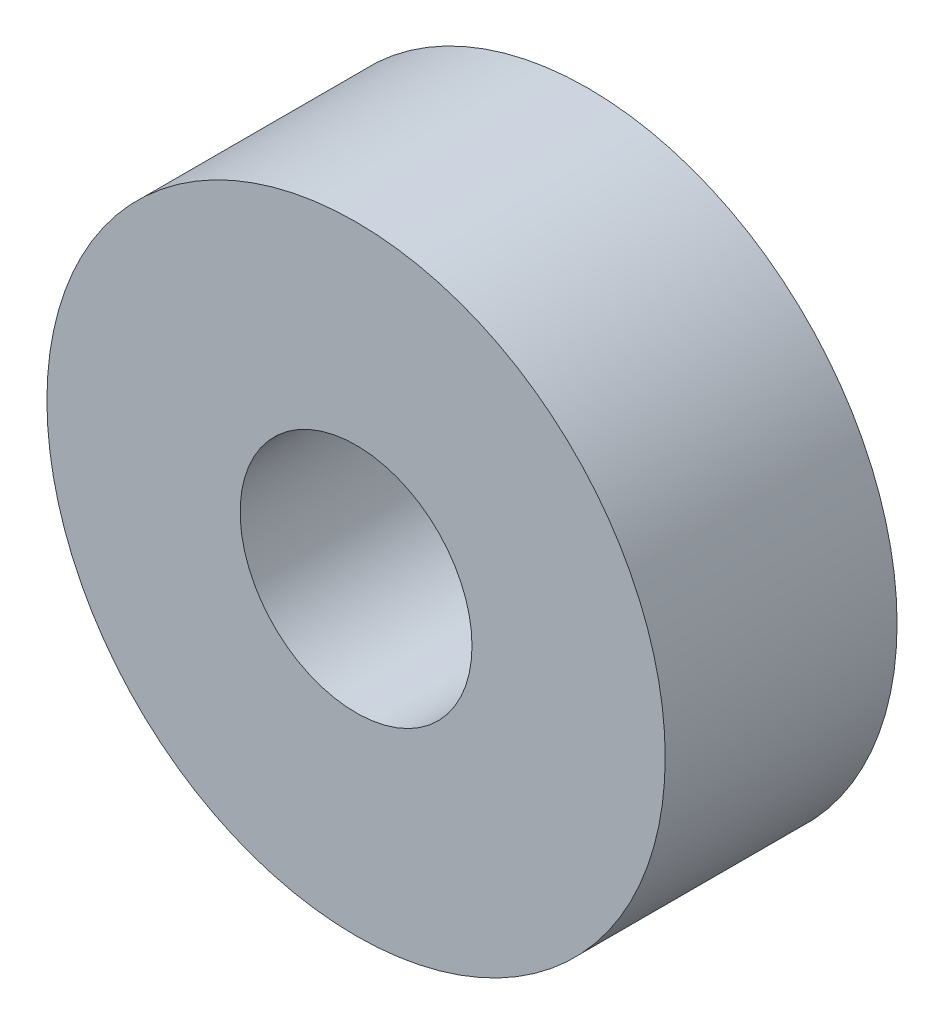
ISO-10303-21;
HEADER;
FILE_DESCRIPTION(('STEP AP214'),'2;1');
FILE_NAME('part.step','',(''),(''),'','','');
FILE_SCHEMA(('AUTOMOTIVE_DESIGN { 1 0 10303 214 1 1 1 1 }'));
ENDSEC;
DATA;
#1=APPLICATION_CONTEXT('core data for automotive mechanical design processes');
#2=APPLICATION_PROTOCOL_DEFINITION('international standard','automotive_design',2000,#1);
#3=PRODUCT_CONTEXT('',#1,'mechanical');
#4=PRODUCT('Part','Part','',(#3));
#5=PRODUCT_RELATED_PRODUCT_CATEGORY('part','',(#4));
#6=PRODUCT_DEFINITION_FORMATION('','',#4);
#7=PRODUCT_DEFINITION_CONTEXT('part definition',#1,'design');
#8=PRODUCT_DEFINITION('design','',#6,#7);
#9=PRODUCT_DEFINITION_SHAPE('','',#8);
#10=(LENGTH_UNIT() NAMED_UNIT(*) SI_UNIT(.MILLI.,.METRE.));
#11=(NAMED_UNIT(*) PLANE_ANGLE_UNIT() SI_UNIT($,.RADIAN.));
#12=(NAMED_UNIT(*) SI_UNIT($,.STERADIAN.) SOLID_ANGLE_UNIT());
#13=UNCERTAINTY_MEASURE_WITH_UNIT(LENGTH_MEASURE(1.E-05),#10,'distance_accuracy_value','');
#14=(GEOMETRIC_REPRESENTATION_CONTEXT(3) GLOBAL_UNCERTAINTY_ASSIGNED_CONTEXT((#13)) GLOBAL_UNIT_ASSIGNED_CONTEXT((#10,
#11,#12)) REPRESENTATION_CONTEXT('',''));
#15=CARTESIAN_POINT('',(0.,0.,0.));
#16=DIRECTION('',(0.,0.,1.));
#17=DIRECTION('',(1.,0.,0.));
#18=AXIS2_PLACEMENT_3D('',#15,#16,#17);
#19=CARTESIAN_POINT('',(0.,0.,12.));
#20=DIRECTION('',(0.,0.,1.));
#21=DIRECTION('',(1.,0.,0.));
#22=AXIS2_PLACEMENT_3D('',#19,#20,#21);
#23=PLANE('',#22);
#24=CARTESIAN_POINT('',(0.,0.,12.));
#25=DIRECTION('',(0.,0.,1.));
#26=DIRECTION('',(1.,0.,0.));
#27=AXIS2_PLACEMENT_3D('',#24,#25,#26);
#28=CIRCLE('',#27,16.);
#29=CARTESIAN_POINT('',(16.,0.,12.));
#30=VERTEX_POINT('',#29);
#31=EDGE_CURVE('E10',#30,#30,#28,.T.);
#32=ORIENTED_EDGE('',*,*,#31,.T.);
#33=EDGE_LOOP('',(#32));
#34=FACE_BOUND('',#33,.T.);
#35=CARTESIAN_POINT('',(0.,0.,12.));
#36=DIRECTION('',(0.,0.,1.));
#37=DIRECTION('',(1.,0.,0.));
#38=AXIS2_PLACEMENT_3D('',#35,#36,#37);
#39=CIRCLE('',#38,6.);
#40=CARTESIAN_POINT('',(6.,0.,12.));
#41=VERTEX_POINT('',#40);
#42=EDGE_CURVE('E42',#41,#41,#39,.T.);
#43=ORIENTED_EDGE('',*,*,#42,.F.);
#44=EDGE_LOOP('',(#43));
#45=FACE_BOUND('',#44,.T.);
#46=ADVANCED_FACE('F31',(#34,#45),#23,.T.);
#47=CARTESIAN_POINT('',(0.,0.,0.));
#48=DIRECTION('',(0.,0.,1.));
#49=DIRECTION('',(1.,0.,0.));
#50=AXIS2_PLACEMENT_3D('',#47,#48,#49);
#51=PLANE('',#50);
#52=CARTESIAN_POINT('',(0.,0.,0.));
#53=DIRECTION('',(0.,0.,1.));
#54=DIRECTION('',(1.,0.,0.));
#55=AXIS2_PLACEMENT_3D('',#52,#53,#54);
#56=CIRCLE('',#55,16.);
#57=CARTESIAN_POINT('',(16.,0.,0.));
#58=VERTEX_POINT('',#57);
#59=EDGE_CURVE('E35',#58,#58,#56,.T.);
#60=ORIENTED_EDGE('',*,*,#59,.F.);
#61=EDGE_LOOP('',(#60));
#62=FACE_BOUND('',#61,.T.);
#63=CARTESIAN_POINT('',(0.,0.,0.));
#64=DIRECTION('',(0.,0.,1.));
#65=DIRECTION('',(1.,0.,0.));
#66=AXIS2_PLACEMENT_3D('',#63,#64,#65);
#67=CIRCLE('',#66,6.);
#68=CARTESIAN_POINT('',(6.,0.,0.));
#69=VERTEX_POINT('',#68);
#70=EDGE_CURVE('E44',#69,#69,#67,.T.);
#71=ORIENTED_EDGE('',*,*,#70,.T.);
#72=EDGE_LOOP('',(#71));
#73=FACE_BOUND('',#72,.T.);
#74=ADVANCED_FACE('F54',(#62,#73),#51,.F.);
#75=CARTESIAN_POINT('',(0.,0.,12.));
#76=DIRECTION('',(0.,0.,-1.));
#77=DIRECTION('',(-1.,0.,0.));
#78=AXIS2_PLACEMENT_3D('',#75,#76,#77);
#79=CYLINDRICAL_SURFACE('',#78,16.);
#80=ORIENTED_EDGE('',*,*,#31,.F.);
#81=EDGE_LOOP('',(#80));
#82=FACE_BOUND('',#81,.T.);
#83=ORIENTED_EDGE('',*,*,#59,.T.);
#84=EDGE_LOOP('',(#83));
#85=FACE_BOUND('',#84,.T.);
#86=ADVANCED_FACE('F33',(#82,#85),#79,.T.);
#87=CARTESIAN_POINT('',(0.,0.,12.));
#88=DIRECTION('',(0.,0.,-1.));
#89=DIRECTION('',(-1.,0.,0.));
#90=AXIS2_PLACEMENT_3D('',#87,#88,#89);
#91=CYLINDRICAL_SURFACE('',#90,6.);
#92=ORIENTED_EDGE('',*,*,#42,.T.);
#93=EDGE_LOOP('',(#92));
#94=FACE_BOUND('',#93,.T.);
#95=ORIENTED_EDGE('',*,*,#70,.F.);
#96=EDGE_LOOP('',(#95));
#97=FACE_BOUND('',#96,.T.);
#98=ADVANCED_FACE('F50',(#94,#97),#91,.F.);
#99=CLOSED_SHELL('',(#46,#74,#86,#98));
#100=MANIFOLD_SOLID_BREP('B2',#99);
#101=ADVANCED_BREP_SHAPE_REPRESENTATION('',(#18,#100),#14);
#102=SHAPE_DEFINITION_REPRESENTATION(#9,#101);
ENDSEC;
END-ISO-10303-21;
